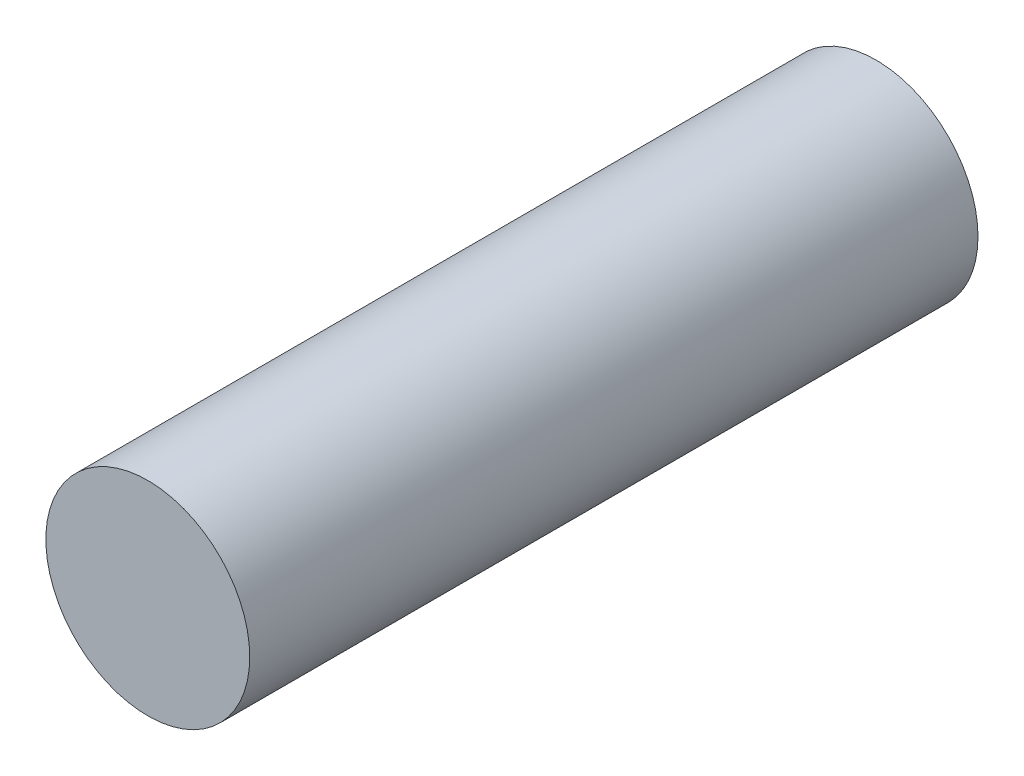
ISO-10303-21;
HEADER;
FILE_DESCRIPTION(('STEP AP214'),'2;1');
FILE_NAME('part.step','',(''),(''),'','','');
FILE_SCHEMA(('AUTOMOTIVE_DESIGN { 1 0 10303 214 1 1 1 1 }'));
ENDSEC;
DATA;
#1=APPLICATION_CONTEXT('core data for automotive mechanical design processes');
#2=APPLICATION_PROTOCOL_DEFINITION('international standard','automotive_design',2000,#1);
#3=PRODUCT_CONTEXT('',#1,'mechanical');
#4=PRODUCT('Part','Part','',(#3));
#5=PRODUCT_RELATED_PRODUCT_CATEGORY('part','',(#4));
#6=PRODUCT_DEFINITION_FORMATION('','',#4);
#7=PRODUCT_DEFINITION_CONTEXT('part definition',#1,'design');
#8=PRODUCT_DEFINITION('design','',#6,#7);
#9=PRODUCT_DEFINITION_SHAPE('','',#8);
#10=(LENGTH_UNIT() NAMED_UNIT(*) SI_UNIT(.MILLI.,.METRE.));
#11=(NAMED_UNIT(*) PLANE_ANGLE_UNIT() SI_UNIT($,.RADIAN.));
#12=(NAMED_UNIT(*) SI_UNIT($,.STERADIAN.) SOLID_ANGLE_UNIT());
#13=UNCERTAINTY_MEASURE_WITH_UNIT(LENGTH_MEASURE(1.E-05),#10,'distance_accuracy_value','');
#14=(GEOMETRIC_REPRESENTATION_CONTEXT(3) GLOBAL_UNCERTAINTY_ASSIGNED_CONTEXT((#13)) GLOBAL_UNIT_ASSIGNED_CONTEXT((#10,
#11,#12)) REPRESENTATION_CONTEXT('',''));
#15=CARTESIAN_POINT('',(0.,0.,0.));
#16=DIRECTION('',(0.,0.,1.));
#17=DIRECTION('',(1.,0.,0.));
#18=AXIS2_PLACEMENT_3D('',#15,#16,#17);
#19=CARTESIAN_POINT('',(0.,0.,25.));
#20=DIRECTION('',(0.,0.,-1.));
#21=DIRECTION('',(-1.,0.,0.));
#22=AXIS2_PLACEMENT_3D('',#19,#20,#21);
#23=CYLINDRICAL_SURFACE('',#22,3.5);
#24=CARTESIAN_POINT('',(0.,0.,25.));
#25=DIRECTION('',(0.,0.,1.));
#26=DIRECTION('',(1.,0.,0.));
#27=AXIS2_PLACEMENT_3D('',#24,#25,#26);
#28=CIRCLE('',#27,3.5);
#29=CARTESIAN_POINT('',(3.5,0.,25.));
#30=VERTEX_POINT('',#29);
#31=EDGE_CURVE('E10',#30,#30,#28,.T.);
#32=ORIENTED_EDGE('',*,*,#31,.F.);
#33=EDGE_LOOP('',(#32));
#34=FACE_BOUND('',#33,.T.);
#35=CARTESIAN_POINT('',(0.,0.,0.));
#36=DIRECTION('',(0.,0.,1.));
#37=DIRECTION('',(1.,0.,0.));
#38=AXIS2_PLACEMENT_3D('',#35,#36,#37);
#39=CIRCLE('',#38,3.5);
#40=CARTESIAN_POINT('',(3.5,0.,0.));
#41=VERTEX_POINT('',#40);
#42=EDGE_CURVE('E46',#41,#41,#39,.T.);
#43=ORIENTED_EDGE('',*,*,#42,.T.);
#44=EDGE_LOOP('',(#43));
#45=FACE_BOUND('',#44,.T.);
#46=ADVANCED_FACE('F43',(#34,#45),#23,.T.);
#47=CARTESIAN_POINT('',(0.,0.,25.));
#48=DIRECTION('',(0.,0.,1.));
#49=DIRECTION('',(1.,0.,0.));
#50=AXIS2_PLACEMENT_3D('',#47,#48,#49);
#51=PLANE('',#50);
#52=ORIENTED_EDGE('',*,*,#31,.T.);
#53=EDGE_LOOP('',(#52));
#54=FACE_BOUND('',#53,.T.);
#55=ADVANCED_FACE('F58',(#54),#51,.T.);
#56=CARTESIAN_POINT('',(0.,0.,0.));
#57=DIRECTION('',(0.,0.,1.));
#58=DIRECTION('',(1.,0.,0.));
#59=AXIS2_PLACEMENT_3D('',#56,#57,#58);
#60=PLANE('',#59);
#61=ORIENTED_EDGE('',*,*,#42,.F.);
#62=EDGE_LOOP('',(#61));
#63=FACE_BOUND('',#62,.T.);
#64=ADVANCED_FACE('F56',(#63),#60,.F.);
#65=CLOSED_SHELL('',(#46,#55,#64));
#66=MANIFOLD_SOLID_BREP('B2',#65);
#67=ADVANCED_BREP_SHAPE_REPRESENTATION('',(#18,#66),#14);
#68=SHAPE_DEFINITION_REPRESENTATION(#9,#67);
ENDSEC;
END-ISO-10303-21;
